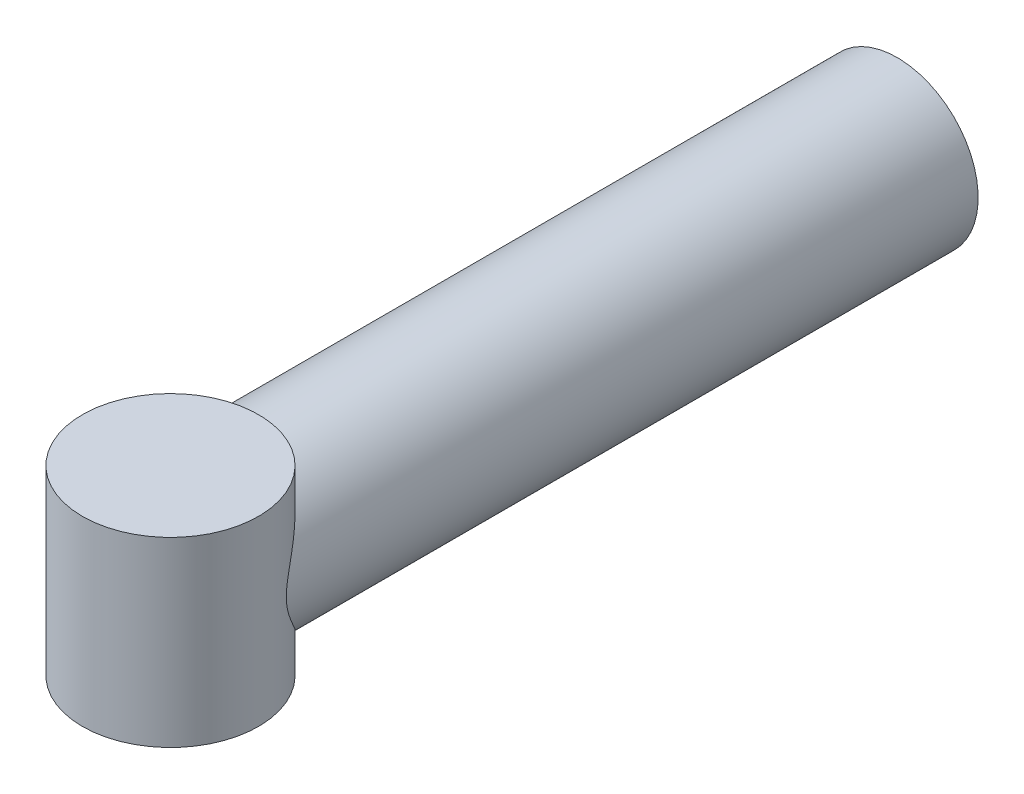
ISO-10303-21;
HEADER;
FILE_DESCRIPTION(('STEP AP214'),'2;1');
FILE_NAME('part.step','',(''),(''),'','','');
FILE_SCHEMA(('AUTOMOTIVE_DESIGN { 1 0 10303 214 1 1 1 1 }'));
ENDSEC;
DATA;
#1=APPLICATION_CONTEXT('core data for automotive mechanical design processes');
#2=APPLICATION_PROTOCOL_DEFINITION('international standard','automotive_design',2000,#1);
#3=PRODUCT_CONTEXT('',#1,'mechanical');
#4=PRODUCT('Part','Part','',(#3));
#5=PRODUCT_RELATED_PRODUCT_CATEGORY('part','',(#4));
#6=PRODUCT_DEFINITION_FORMATION('','',#4);
#7=PRODUCT_DEFINITION_CONTEXT('part definition',#1,'design');
#8=PRODUCT_DEFINITION('design','',#6,#7);
#9=PRODUCT_DEFINITION_SHAPE('','',#8);
#10=(LENGTH_UNIT() NAMED_UNIT(*) SI_UNIT(.MILLI.,.METRE.));
#11=(NAMED_UNIT(*) PLANE_ANGLE_UNIT() SI_UNIT($,.RADIAN.));
#12=(NAMED_UNIT(*) SI_UNIT($,.STERADIAN.) SOLID_ANGLE_UNIT());
#13=UNCERTAINTY_MEASURE_WITH_UNIT(LENGTH_MEASURE(1.E-05),#10,'distance_accuracy_value','');
#14=(GEOMETRIC_REPRESENTATION_CONTEXT(3) GLOBAL_UNCERTAINTY_ASSIGNED_CONTEXT((#13)) GLOBAL_UNIT_ASSIGNED_CONTEXT((#10,
#11,#12)) REPRESENTATION_CONTEXT('',''));
#15=CARTESIAN_POINT('',(0.,0.,0.));
#16=DIRECTION('',(0.,0.,1.));
#17=DIRECTION('',(1.,0.,0.));
#18=AXIS2_PLACEMENT_3D('',#15,#16,#17);
#19=CARTESIAN_POINT('',(0.,22.5,79.7384381673112));
#20=DIRECTION('',(0.,-1.,0.));
#21=DIRECTION('',(0.,0.,-1.));
#22=AXIS2_PLACEMENT_3D('',#19,#20,#21);
#23=CYLINDRICAL_SURFACE('',#22,21.7897785141328);
#24=CARTESIAN_POINT('',(0.,22.5,79.7384381673112));
#25=DIRECTION('',(0.,1.,0.));
#26=DIRECTION('',(0.,0.,1.));
#27=AXIS2_PLACEMENT_3D('',#24,#25,#26);
#28=CIRCLE('',#27,21.7897785141328);
#29=CARTESIAN_POINT('',(0.,22.5,101.528216681444));
#30=VERTEX_POINT('',#29);
#31=EDGE_CURVE('E94',#30,#30,#28,.T.);
#32=ORIENTED_EDGE('',*,*,#31,.F.);
#33=EDGE_LOOP('',(#32));
#34=FACE_BOUND('',#33,.T.);
#35=CARTESIAN_POINT('',(0.,-22.5,79.7384381673112));
#36=DIRECTION('',(0.,1.,0.));
#37=DIRECTION('',(0.,0.,1.));
#38=AXIS2_PLACEMENT_3D('',#35,#36,#37);
#39=CIRCLE('',#38,21.7897785141328);
#40=CARTESIAN_POINT('',(0.,-22.5,101.528216681444));
#41=VERTEX_POINT('',#40);
#42=EDGE_CURVE('E60',#41,#41,#39,.T.);
#43=ORIENTED_EDGE('',*,*,#42,.T.);
#44=EDGE_LOOP('',(#43));
#45=FACE_BOUND('',#44,.T.);
#46=CARTESIAN_POINT('',(-20.,0.,71.0900598398464));
#47=CARTESIAN_POINT('',(-20.0000003572792,-0.28248635995844,71.0900611760895));
#48=CARTESIAN_POINT('',(-19.9939947332945,-0.564967834462663,71.0761325087891));
#49=CARTESIAN_POINT('',(-19.9702133636225,-1.12679786874057,71.0214497676802));
#50=CARTESIAN_POINT('',(-19.9524362772046,-1.40614606795849,70.9806926382015));
#51=CARTESIAN_POINT('',(-19.9056454359633,-1.96035418023474,70.8748581883427));
#52=CARTESIAN_POINT('',(-19.8765852636115,-2.23519059963312,70.8096804431835));
#53=CARTESIAN_POINT('',(-19.8080374855605,-2.77786409045319,70.6586282622042));
#54=CARTESIAN_POINT('',(-19.7685440046747,-3.0456971244569,70.5727421675208));
#55=CARTESIAN_POINT('',(-19.6907617627878,-3.50925755055089,70.4070633814724));
#56=CARTESIAN_POINT('',(-19.6545254750975,-3.70664875964659,70.3308875822483));
#57=CARTESIAN_POINT('',(-19.5768885065106,-4.09695021890429,70.1703741962422));
#58=CARTESIAN_POINT('',(-19.5354895131355,-4.28986190894655,70.0860392784224));
#59=CARTESIAN_POINT('',(-19.4038760259827,-4.86242358702407,69.8226720285174));
#60=CARTESIAN_POINT('',(-19.3062837266498,-5.23567351611419,69.6333614371278));
#61=CARTESIAN_POINT('',(-19.0927621259315,-5.96759739242854,69.2354807974977));
#62=CARTESIAN_POINT('',(-18.9767787807289,-6.32622433661935,69.0268547654054));
#63=CARTESIAN_POINT('',(-18.7276432043651,-7.02954455884812,68.5970045337474));
#64=CARTESIAN_POINT('',(-18.594493853971,-7.37424016209786,68.3757824514976));
#65=CARTESIAN_POINT('',(-18.3241788616531,-8.02097612211901,67.9453182071517));
#66=CARTESIAN_POINT('',(-18.1884326031341,-8.32407754792096,67.7367693122606));
#67=CARTESIAN_POINT('',(-17.9033013564316,-8.92082720114438,67.3154364902626));
#68=CARTESIAN_POINT('',(-17.7539145700074,-9.21447417525667,67.102652007675));
#69=CARTESIAN_POINT('',(-17.4414881495564,-9.79298823916839,66.6747803988144));
#70=CARTESIAN_POINT('',(-17.2784409139607,-10.0778503182388,66.459692049358));
#71=CARTESIAN_POINT('',(-16.9387299103715,-10.6389356480963,66.0289829451423));
#72=CARTESIAN_POINT('',(-16.7620648522505,-10.9151580768854,65.8133621418169));
#73=CARTESIAN_POINT('',(-16.2119545434275,-11.730403788404,65.1684068786787));
#74=CARTESIAN_POINT('',(-15.8179607238608,-12.2568078143143,64.7403770732155));
#75=CARTESIAN_POINT('',(-14.9743114436707,-13.2742707988032,63.8979881856978));
#76=CARTESIAN_POINT('',(-14.5246860889363,-13.7653486491174,63.4836218618771));
#77=CARTESIAN_POINT('',(-13.6891202854943,-14.5897210158038,62.779043335664));
#78=CARTESIAN_POINT('',(-13.3157496671708,-14.9315554610108,62.4838922460962));
#79=CARTESIAN_POINT('',(-12.5367283975626,-15.5913765395692,61.9098375834796));
#80=CARTESIAN_POINT('',(-12.1310780668647,-15.9093634097024,61.6309338491174));
#81=CARTESIAN_POINT('',(-11.2879832649086,-16.5182107715538,61.0937267978679));
#82=CARTESIAN_POINT('',(-10.8505849964875,-16.8091093303085,60.8353946481816));
#83=CARTESIAN_POINT('',(-10.1709008734813,-17.2227501543266,60.4663414288393));
#84=CARTESIAN_POINT('',(-9.94042099926592,-17.3568395330614,60.3464036239859));
#85=CARTESIAN_POINT('',(-9.47162764837507,-17.6170416828864,60.1131668312528));
#86=CARTESIAN_POINT('',(-9.23331218491498,-17.7431524068401,59.9998695477199));
#87=CARTESIAN_POINT('',(-8.60475970769942,-18.0594905657577,59.7151402957496));
#88=CARTESIAN_POINT('',(-8.20861970868929,-18.2431423245337,59.5492985400035));
#89=CARTESIAN_POINT('',(-7.39828948240311,-18.5865248679967,59.2384861816186));
#90=CARTESIAN_POINT('',(-6.98410325143047,-18.7462609143627,59.0935109884143));
#91=CARTESIAN_POINT('',(-6.13942475905216,-19.0396228607865,58.8267677546328));
#92=CARTESIAN_POINT('',(-5.70893763283468,-19.1732569032616,58.7049924772261));
#93=CARTESIAN_POINT('',(-4.83387999030584,-19.4123491767946,58.4868180853634));
#94=CARTESIAN_POINT('',(-4.38930932145478,-19.5178071025585,58.3904192458666));
#95=CARTESIAN_POINT('',(-3.48603665147611,-19.6992674283498,58.2243908126248));
#96=CARTESIAN_POINT('',(-3.02725987452898,-19.7750675433687,58.1549450810515));
#97=CARTESIAN_POINT('',(-2.1020717635314,-19.8946936979974,58.0452891966034));
#98=CARTESIAN_POINT('',(-1.63566040870281,-19.9385196505719,58.0050791233094));
#99=CARTESIAN_POINT('',(-0.699442626089152,-19.9932633538939,57.9548455175677));
#100=CARTESIAN_POINT('',(-0.22963741167008,-20.0041923337382,57.9448116847228));
#101=CARTESIAN_POINT('',(0.709216063219477,-19.9929326169856,57.9551465038911));
#102=CARTESIAN_POINT('',(1.17826438185688,-19.9707465997382,57.9755126962244));
#103=CARTESIAN_POINT('',(2.0616027684016,-19.8978591879361,58.0423770654607));
#104=CARTESIAN_POINT('',(2.47640125457342,-19.8504487278428,58.0858589808239));
#105=CARTESIAN_POINT('',(3.29918613292553,-19.7303874221606,58.1958743269091));
#106=CARTESIAN_POINT('',(3.70717311084469,-19.6577387587078,58.2624057647306));
#107=CARTESIAN_POINT('',(4.51387812578193,-19.4883251122128,58.4173666096859));
#108=CARTESIAN_POINT('',(4.91259539190978,-19.3915581312242,58.5057978309803));
#109=CARTESIAN_POINT('',(5.69862480994007,-19.1752929955066,58.7031261447758));
#110=CARTESIAN_POINT('',(6.08593629004327,-19.0557935049159,58.8120244400071));
#111=CARTESIAN_POINT('',(6.86427751615628,-18.789844023563,59.0539150526225));
#112=CARTESIAN_POINT('',(7.25471359705718,-18.6424355580195,59.1877602148464));
#113=CARTESIAN_POINT('',(8.0197688429527,-18.3263375645778,59.4740701566773));
#114=CARTESIAN_POINT('',(8.39438800957018,-18.1576480388632,59.6265349343738));
#115=CARTESIAN_POINT('',(9.12684589740211,-17.8007496226652,59.9481590894689));
#116=CARTESIAN_POINT('',(9.48468144652722,-17.6125370637604,60.1173216041194));
#117=CARTESIAN_POINT('',(10.182866165579,-17.2183051734186,60.4704127788643));
#118=CARTESIAN_POINT('',(10.5232115852937,-17.0122820482529,60.6543445842856));
#119=CARTESIAN_POINT('',(11.3603997917174,-16.4713053061508,61.1353230142865));
#120=CARTESIAN_POINT('',(11.8453793759681,-16.1255426177975,61.4409723721199));
#121=CARTESIAN_POINT('',(12.773265036337,-15.4009914058984,62.0762023746111));
#122=CARTESIAN_POINT('',(13.2161519258357,-15.0221879712133,62.4057938128865));
#123=CARTESIAN_POINT('',(14.0612795385175,-14.2342939673675,63.0840331419917));
#124=CARTESIAN_POINT('',(14.4634009939412,-13.8251202682369,63.4327325984902));
#125=CARTESIAN_POINT('',(15.2262138066704,-12.9802294400468,64.1426615789099));
#126=CARTESIAN_POINT('',(15.5869129010945,-12.5445172913437,64.5038887463641));
#127=CARTESIAN_POINT('',(16.2762300953977,-11.6368870600109,65.2422280887121));
#128=CARTESIAN_POINT('',(16.6038326994043,-11.1643396230547,65.6195121216801));
#129=CARTESIAN_POINT('',(17.217367306302,-10.1927769991871,66.3745655799328));
#130=CARTESIAN_POINT('',(17.5032811361513,-9.69375039794832,66.7523351449128));
#131=CARTESIAN_POINT('',(17.9004857988479,-8.92498601079619,67.31187902848));
#132=CARTESIAN_POINT('',(18.0274779037477,-8.66567956837124,67.496993481501));
#133=CARTESIAN_POINT('',(18.2710064369723,-8.139677748946,67.8635434673288));
#134=CARTESIAN_POINT('',(18.3875440604192,-7.87298322110109,68.0449794188097));
#135=CARTESIAN_POINT('',(18.6099370782173,-7.33183145867082,68.402259919214));
#136=CARTESIAN_POINT('',(18.7158005929675,-7.05738033161961,68.5781086478247));
#137=CARTESIAN_POINT('',(18.9166591827064,-6.49983071063637,68.9220581501028));
#138=CARTESIAN_POINT('',(19.0116567029901,-6.2167341805159,69.0901606618822));
#139=CARTESIAN_POINT('',(19.1772978028237,-5.68308524466734,69.3919002304823));
#140=CARTESIAN_POINT('',(19.2494712615338,-5.43382809000155,69.5269824044619));
#141=CARTESIAN_POINT('',(19.3851943502404,-4.92776508253637,69.7870468129796));
#142=CARTESIAN_POINT('',(19.4487440979395,-4.67095933282386,69.9120291853577));
#143=CARTESIAN_POINT('',(19.5666038958633,-4.14962007147203,70.1488637407674));
#144=CARTESIAN_POINT('',(19.6209246713158,-3.88509595448173,70.2607311175386));
#145=CARTESIAN_POINT('',(19.7196999801292,-3.34783236365247,70.4679974996239));
#146=CARTESIAN_POINT('',(19.7641563150871,-3.07509440030461,70.5633995113901));
#147=CARTESIAN_POINT('',(19.835543689033,-2.56991465698943,70.7189224476781));
#148=CARTESIAN_POINT('',(19.8641782197508,-2.33872009183261,70.782293940923));
#149=CARTESIAN_POINT('',(19.91361222915,-1.8716702733388,70.8927516503787));
#150=CARTESIAN_POINT('',(19.9344141773357,-1.63581651370543,70.9398429991088));
#151=CARTESIAN_POINT('',(19.9676888311595,-1.1609987762512,71.0156188315472));
#152=CARTESIAN_POINT('',(19.9801769000767,-0.922041371792785,71.0443372628492));
#153=CARTESIAN_POINT('',(19.9965496539802,-0.442265787116113,71.0820599746344));
#154=CARTESIAN_POINT('',(20.0004346514609,-0.201447674804308,71.0910649711802));
#155=CARTESIAN_POINT('',(19.9994868890063,0.280675900510312,71.0888732663462));
#156=CARTESIAN_POINT('',(19.9946324871611,0.521981091178815,71.0776264140584));
#157=CARTESIAN_POINT('',(19.9763059050874,1.00251359399952,71.0354405772472));
#158=CARTESIAN_POINT('',(19.9628333922811,1.24174082560094,71.0045008327638));
#159=CARTESIAN_POINT('',(19.9275962101371,1.71691197309894,70.9244007797162));
#160=CARTESIAN_POINT('',(19.9058165438277,1.95284914619686,70.8752075223255));
#161=CARTESIAN_POINT('',(19.8544476126255,2.41995250095189,70.7607275529592));
#162=CARTESIAN_POINT('',(19.8248552400749,2.65111674454339,70.6954344376318));
#163=CARTESIAN_POINT('',(19.7389528416094,3.241529531484,70.5089218431146));
#164=CARTESIAN_POINT('',(19.6771344800041,3.59670107341507,70.3773154639281));
#165=CARTESIAN_POINT('',(19.5370469769259,4.29303738735554,70.0883598687633));
#166=CARTESIAN_POINT('',(19.4587659314387,4.63419180916719,69.9309920432674));
#167=CARTESIAN_POINT('',(19.2868375591216,5.30453102851535,69.5970497005369));
#168=CARTESIAN_POINT('',(19.1931332729075,5.63366571286817,69.4204048386497));
#169=CARTESIAN_POINT('',(18.9915317392251,6.27982906877321,69.0538728785239));
#170=CARTESIAN_POINT('',(18.8836366240762,6.59685954989148,68.8639877717798));
#171=CARTESIAN_POINT('',(18.6567744814889,7.21319436939717,68.4793089028174));
#172=CARTESIAN_POINT('',(18.5381058524331,7.51273585053304,68.2847172139081));
#173=CARTESIAN_POINT('',(18.2880490085117,8.1024592546616,67.8895389036377));
#174=CARTESIAN_POINT('',(18.1566586541723,8.39263959236797,67.6889512778459));
#175=CARTESIAN_POINT('',(17.8812449450892,8.96447722482946,67.2838989594852));
#176=CARTESIAN_POINT('',(17.7372135928139,9.24612897007442,67.079431877564));
#177=CARTESIAN_POINT('',(17.4366330883591,9.80119392963664,66.6685054884422));
#178=CARTESIAN_POINT('',(17.2800826489563,10.0746062927839,66.4620459783025));
#179=CARTESIAN_POINT('',(16.7917573383597,10.882707127326,65.8421178406379));
#180=CARTESIAN_POINT('',(16.4411515991456,11.4055843065955,65.4278652863788));
#181=CARTESIAN_POINT('',(15.6892206203267,12.4195952593169,64.6072554692453));
#182=CARTESIAN_POINT('',(15.2879199372172,12.910744228893,64.200894492935));
#183=CARTESIAN_POINT('',(14.5078388719998,13.7768037286288,63.4734518695891));
#184=CARTESIAN_POINT('',(14.13733066117,14.1570505792372,63.14985424267));
#185=CARTESIAN_POINT('',(13.3602314126824,14.892632379426,62.5178240715015));
#186=CARTESIAN_POINT('',(12.9536384316519,15.2479659854376,62.209392345415));
#187=CARTESIAN_POINT('',(12.1046768836881,15.930244914601,61.6127700580446));
#188=CARTESIAN_POINT('',(11.6623703386561,16.2572374916575,61.3245459635045));
#189=CARTESIAN_POINT('',(10.9720303193811,16.7239857301829,60.9107725089728));
#190=CARTESIAN_POINT('',(10.7374554735786,16.8756012652948,60.775951183973));
#191=CARTESIAN_POINT('',(10.2593245829736,17.1704737986945,60.5130603499061));
#192=CARTESIAN_POINT('',(10.0157663139267,17.3137287039564,60.3849925323003));
#193=CARTESIAN_POINT('',(9.38524365377179,17.6666167662132,60.0687978769084));
#194=CARTESIAN_POINT('',(8.99219360998417,17.8700761405912,59.8858007069753));
#195=CARTESIAN_POINT('',(8.186235509903,18.2533452503572,59.5401160415693));
#196=CARTESIAN_POINT('',(7.77333215133454,18.4331605432046,59.3774237739584));
#197=CARTESIAN_POINT('',(6.92913060676511,18.7668070500378,59.0748821213027));
#198=CARTESIAN_POINT('',(6.49783715271052,18.9206448983334,58.935026904267));
#199=CARTESIAN_POINT('',(5.61886605752035,19.2000253910914,58.6806108665613));
#200=CARTESIAN_POINT('',(5.17118820030012,19.325567662223,58.5660503796294));
#201=CARTESIAN_POINT('',(4.25868703321097,19.5470122082805,58.3637313842014));
#202=CARTESIAN_POINT('',(3.79375684931506,19.6426744812833,58.2761899613456));
#203=CARTESIAN_POINT('',(2.85367547428726,19.8011037797231,58.1310980970539));
#204=CARTESIAN_POINT('',(2.37852425422598,19.8638707120411,58.0735477405157));
#205=CARTESIAN_POINT('',(1.4224353310332,19.9551286011376,57.9898456990057));
#206=CARTESIAN_POINT('',(0.941500821485025,19.9836376699871,57.9636774223992));
#207=CARTESIAN_POINT('',(-0.0218212092103692,20.005788300199,57.9433471772745));
#208=CARTESIAN_POINT('',(-0.504208568186972,19.9994336187627,57.9491817598677));
#209=CARTESIAN_POINT('',(-1.40709908668984,19.9549193279786,57.9900314933659));
#210=CARTESIAN_POINT('',(-1.82797388316128,19.9207335357678,58.0214006603827));
#211=CARTESIAN_POINT('',(-2.66424332886874,19.8262158380741,58.1080677320468));
#212=CARTESIAN_POINT('',(-3.07963851330049,19.7658865058179,58.1633632816945));
#213=CARTESIAN_POINT('',(-3.90223646601112,19.620068120257,58.2968742652014));
#214=CARTESIAN_POINT('',(-4.30943885313428,19.5345778992638,58.3750907627953));
#215=CARTESIAN_POINT('',(-5.11326928763226,19.3397397320065,58.5531033116574));
#216=CARTESIAN_POINT('',(-5.5098967741772,19.2303905232165,58.6529005048905));
#217=CARTESIAN_POINT('',(-6.29852849405549,18.98689826423,58.8747332619868));
#218=CARTESIAN_POINT('',(-6.69027482841141,18.8522963712543,58.9971796660797));
#219=CARTESIAN_POINT('',(-7.45904300774888,18.5615620874849,59.2610771434985));
#220=CARTESIAN_POINT('',(-7.83606510566264,18.4054300667435,59.4025278901832));
#221=CARTESIAN_POINT('',(-8.57429760167227,18.0733308207,59.7026035402509));
#222=CARTESIAN_POINT('',(-8.93550394705475,17.8973585522466,59.8612328098002));
#223=CARTESIAN_POINT('',(-9.641232095497,17.5272780447933,60.1937883069976));
#224=CARTESIAN_POINT('',(-9.98575033965209,17.3331659629257,60.3677177754892));
#225=CARTESIAN_POINT('',(-10.8262977303207,16.8267141025745,60.819825061821));
#226=CARTESIAN_POINT('',(-11.3115366040743,16.503952388982,61.1064942120083));
#227=CARTESIAN_POINT('',(-12.2424452562332,15.8257543642277,61.7044888496532));
#228=CARTESIAN_POINT('',(-12.6880979931938,15.4703041137017,62.0158248478785));
#229=CARTESIAN_POINT('',(-13.5407693430654,14.729803830266,62.6584034521194));
#230=CARTESIAN_POINT('',(-13.9476997342337,14.3446896599089,62.9896888339062));
#231=CARTESIAN_POINT('',(-14.7222974190903,13.5485221167601,63.6663244098141));
#232=CARTESIAN_POINT('',(-15.0899704020456,13.1374725163599,64.0116725558814));
#233=CARTESIAN_POINT('',(-15.7951426190903,12.2812207042018,64.7196721216929));
#234=CARTESIAN_POINT('',(-16.1317210162458,11.8354402044192,65.0825396346472));
#235=CARTESIAN_POINT('',(-16.765420585543,10.9192972032391,65.811896894606));
#236=CARTESIAN_POINT('',(-17.0625315490443,10.448928385504,66.1783875525367));
#237=CARTESIAN_POINT('',(-17.6172638797565,9.48375304714811,66.9073997274666));
#238=CARTESIAN_POINT('',(-17.8749453566086,8.98898527631192,67.269926487795));
#239=CARTESIAN_POINT('',(-18.2319738499236,8.22640259138612,67.8038007391237));
#240=CARTESIAN_POINT('',(-18.3460519270311,7.96884578037025,67.9800789253475));
#241=CARTESIAN_POINT('',(-18.5642735484756,7.44633742606715,68.3277304426973));
#242=CARTESIAN_POINT('',(-18.6684183744524,7.18138684248035,68.4991044045892));
#243=CARTESIAN_POINT('',(-18.8689020499327,6.63706536769014,68.838951110321));
#244=CARTESIAN_POINT('',(-18.9649979819889,6.35750162080035,69.0072593390071));
#245=CARTESIAN_POINT('',(-19.1461392083139,5.78915314843404,69.3338886451562));
#246=CARTESIAN_POINT('',(-19.2311870838856,5.50037059658231,69.4922120510409));
#247=CARTESIAN_POINT('',(-19.3896570858591,4.91262107808144,69.7953555684276));
#248=CARTESIAN_POINT('',(-19.4630789026105,4.6136538404292,69.9401753202286));
#249=CARTESIAN_POINT('',(-19.5974170804695,4.0047946039629,70.2117056863148));
#250=CARTESIAN_POINT('',(-19.6583352928504,3.69490423039188,70.3384189805817));
#251=CARTESIAN_POINT('',(-19.7585521354798,3.1103293068833,70.5511737944867));
#252=CARTESIAN_POINT('',(-19.7997117336784,2.83715498387932,70.6404552430335));
#253=CARTESIAN_POINT('',(-19.8711863892135,2.28337645299683,70.7976397322475));
#254=CARTESIAN_POINT('',(-19.9015068985801,2.00277605691477,70.8655535187199));
#255=CARTESIAN_POINT('',(-19.9503360214293,1.43679047119892,70.9758923891488));
#256=CARTESIAN_POINT('',(-19.9688959543561,1.15143172568808,71.0184281665216));
#257=CARTESIAN_POINT('',(-19.9937267120661,0.577379900876563,71.0755088197463));
#258=CARTESIAN_POINT('',(-19.999999634878,0.288687399290344,71.0900584742706));
#259=CARTESIAN_POINT('',(-20.,0.,71.0900598398464));
#260=B_SPLINE_CURVE_WITH_KNOTS('',3,(#46,#47,#48,#49,#50,#51,#52,#53,#54,#55,#56,#57,#58,#59,
#60,#61,#62,#63,#64,#65,#66,#67,#68,#69,#70,#71,#72,#73,#74,#75,#76,#77,#78,#79,#80,#81,#82,#83,
#84,#85,#86,#87,#88,#89,#90,#91,#92,#93,#94,#95,#96,#97,#98,#99,#100,#101,#102,#103,#104,#105,
#106,#107,#108,#109,#110,#111,#112,#113,#114,#115,#116,#117,#118,#119,#120,#121,#122,#123,#124,
#125,#126,#127,#128,#129,#130,#131,#132,#133,#134,#135,#136,#137,#138,#139,#140,#141,#142,#143,
#144,#145,#146,#147,#148,#149,#150,#151,#152,#153,#154,#155,#156,#157,#158,#159,#160,#161,#162,
#163,#164,#165,#166,#167,#168,#169,#170,#171,#172,#173,#174,#175,#176,#177,#178,#179,#180,#181,
#182,#183,#184,#185,#186,#187,#188,#189,#190,#191,#192,#193,#194,#195,#196,#197,#198,#199,#200,
#201,#202,#203,#204,#205,#206,#207,#208,#209,#210,#211,#212,#213,#214,#215,#216,#217,#218,#219,
#220,#221,#222,#223,#224,#225,#226,#227,#228,#229,#230,#231,#232,#233,#234,#235,#236,#237,#238,
#239,#240,#241,#242,#243,#244,#245,#246,#247,#248,#249,#250,#251,#252,#253,#254,#255,#256,#257,
#258,#259),.UNSPECIFIED.,.T.,.F.,(4,2,2,2,2,2,2,2,2,2,2,2,2,2,2,2,2,2,2,2,2,2,2,2,2,2,2,2,2,2,2,
2,2,2,2,2,2,2,2,2,2,2,2,2,2,2,2,2,2,2,2,2,2,2,2,2,2,2,2,2,2,2,2,2,2,2,2,2,2,2,2,2,2,2,2,2,2,2,2,
2,2,2,2,2,2,2,2,2,2,2,2,2,2,2,2,2,2,2,2,2,2,2,2,2,2,2,4),(0.,0.847061951426545,1.69422039700871,
2.54490154196973,3.39606274591446,4.03976964706402,4.68326669006242,5.97099261850597,
7.26257527894536,8.55394146984323,9.73003835955019,10.9062905194306,12.0832016266586,
13.2602243696371,15.611000827189,17.9605106437044,19.7170016540209,21.4734752218796,
23.2274419522324,24.1043339654017,24.9814500636822,26.3812529618232,27.7807474363319,
29.1798046443653,30.5788770108573,31.9873321804388,33.395791183888,34.8037693675039,
36.2116336371393,37.4694584047576,38.7271744458596,39.9849947100211,41.2428889120458,
42.5564374522148,43.8699858576101,45.1837815303204,46.4978577400449,48.5032384839807,
50.5095289766565,52.5215294423595,54.5331534811019,56.5945869875509,58.6569164481209,
59.6856467510954,60.7142593027346,61.7420833309049,62.7696755994726,63.6469894527702,
64.5242913306506,65.4005665940428,66.2766816864855,67.0003313221939,67.7237526098081,
68.445833343568,69.1678878483334,69.891732881106,70.6156058491646,71.3407918641609,
72.0662667719239,73.2156146290938,74.3657964443101,75.520325429202,76.6746811318953,
77.8034518542551,78.9324127382224,80.06209309852,81.1918897632304,83.4501959465387,
85.7074123771041,87.5710854550738,89.4348589635513,91.2954626350188,92.2256255060946,
93.1560202469021,94.5913961068917,96.0264339813782,97.4611048092916,98.8957945650927,
100.341728104621,101.787665737227,103.232838568379,104.677855659011,105.94662256329,
107.215264615173,108.483965552592,109.75273364107,111.047294474389,112.341833060014,
113.636701446737,114.931844772185,116.877341685308,118.823672097468,120.774335709062,
122.724716241543,124.721288044638,126.718375279247,128.712386984433,129.709075836354,
130.705635915846,131.725768989794,132.745663286277,133.765584742237,134.785355080368,
135.655418929428,136.525044521076,137.390848723369,138.25650507517),.UNSPECIFIED.);
#261=CARTESIAN_POINT('',(-20.,0.,71.0900598398464));
#262=VERTEX_POINT('',#261);
#263=EDGE_CURVE('E10',#262,#262,#260,.T.);
#264=ORIENTED_EDGE('',*,*,#263,.T.);
#265=EDGE_LOOP('',(#264));
#266=FACE_BOUND('',#265,.T.);
#267=ADVANCED_FACE('F36',(#34,#45,#266),#23,.T.);
#268=CARTESIAN_POINT('',(0.,22.5,79.7384381673112));
#269=DIRECTION('',(0.,1.,0.));
#270=DIRECTION('',(0.,0.,1.));
#271=AXIS2_PLACEMENT_3D('',#268,#269,#270);
#272=PLANE('',#271);
#273=ORIENTED_EDGE('',*,*,#31,.T.);
#274=EDGE_LOOP('',(#273));
#275=FACE_BOUND('',#274,.T.);
#276=ADVANCED_FACE('F85',(#275),#272,.T.);
#277=CARTESIAN_POINT('',(0.,-22.5,79.7384381673112));
#278=DIRECTION('',(0.,1.,0.));
#279=DIRECTION('',(0.,0.,1.));
#280=AXIS2_PLACEMENT_3D('',#277,#278,#279);
#281=PLANE('',#280);
#282=ORIENTED_EDGE('',*,*,#42,.F.);
#283=EDGE_LOOP('',(#282));
#284=FACE_BOUND('',#283,.T.);
#285=ADVANCED_FACE('F69',(#284),#281,.F.);
#286=CARTESIAN_POINT('',(0.,0.,80.));
#287=DIRECTION('',(0.,0.,-1.));
#288=DIRECTION('',(-1.,0.,0.));
#289=AXIS2_PLACEMENT_3D('',#286,#287,#288);
#290=CYLINDRICAL_SURFACE('',#289,20.);
#291=CARTESIAN_POINT('',(0.,0.,-100.));
#292=DIRECTION('',(0.,0.,-1.));
#293=DIRECTION('',(-1.,0.,0.));
#294=AXIS2_PLACEMENT_3D('',#291,#292,#293);
#295=CIRCLE('',#294,20.);
#296=CARTESIAN_POINT('',(-20.,0.,-100.));
#297=VERTEX_POINT('',#296);
#298=EDGE_CURVE('E49',#297,#297,#295,.T.);
#299=ORIENTED_EDGE('',*,*,#298,.F.);
#300=EDGE_LOOP('',(#299));
#301=FACE_BOUND('',#300,.T.);
#302=ORIENTED_EDGE('',*,*,#263,.F.);
#303=EDGE_LOOP('',(#302));
#304=FACE_BOUND('',#303,.T.);
#305=ADVANCED_FACE('F38',(#301,#304),#290,.T.);
#306=CARTESIAN_POINT('',(0.,0.,80.));
#307=DIRECTION('',(0.,0.,-1.));
#308=DIRECTION('',(-1.,0.,0.));
#309=AXIS2_PLACEMENT_3D('',#306,#307,#308);
#310=CYLINDRICAL_SURFACE('',#309,15.);
#311=CARTESIAN_POINT('',(0.,0.,-100.));
#312=DIRECTION('',(0.,0.,-1.));
#313=DIRECTION('',(-1.,0.,0.));
#314=AXIS2_PLACEMENT_3D('',#311,#312,#313);
#315=CIRCLE('',#314,15.);
#316=CARTESIAN_POINT('',(-15.,0.,-100.));
#317=VERTEX_POINT('',#316);
#318=EDGE_CURVE('E54',#317,#317,#315,.T.);
#319=ORIENTED_EDGE('',*,*,#318,.T.);
#320=EDGE_LOOP('',(#319));
#321=FACE_BOUND('',#320,.T.);
#322=CARTESIAN_POINT('',(-15.,0.,63.9335513377587));
#323=CARTESIAN_POINT('',(-14.9999965125222,-0.362177097061445,63.933545087432));
#324=CARTESIAN_POINT('',(-14.9868527580879,-0.724405802017627,63.9210416143776));
#325=CARTESIAN_POINT('',(-14.9345819629865,-1.44532788372272,63.8716819780383));
#326=CARTESIAN_POINT('',(-14.8954494567292,-1.80402050070439,63.8348206921677));
#327=CARTESIAN_POINT('',(-14.7919937530774,-2.51520582213886,63.7385526002777));
#328=CARTESIAN_POINT('',(-14.7276320143901,-2.86768817452836,63.6791113043512));
#329=CARTESIAN_POINT('',(-14.5749070844514,-3.5635793877466,63.5403783848185));
#330=CARTESIAN_POINT('',(-14.4865298835007,-3.90698282357194,63.4610751766565));
#331=CARTESIAN_POINT('',(-14.2882408596077,-4.57903996400495,63.2867565313099));
#332=CARTESIAN_POINT('',(-14.1785741778342,-4.90781361419552,63.1919217152761));
#333=CARTESIAN_POINT('',(-13.9384178413728,-5.55329339187417,62.9891207869689));
#334=CARTESIAN_POINT('',(-13.8079353929933,-5.87000364881113,62.8811592221718));
#335=CARTESIAN_POINT('',(-13.527220521727,-6.49079127389133,62.6550771376933));
#336=CARTESIAN_POINT('',(-13.3769861643358,-6.79486740080248,62.5369556233377));
#337=CARTESIAN_POINT('',(-13.057699526354,-7.38989175952804,62.2933453651144));
#338=CARTESIAN_POINT('',(-12.8886459323197,-7.68083907305426,62.1678561073219));
#339=CARTESIAN_POINT('',(-12.5025144043006,-8.29702556405656,61.8905487958121));
#340=CARTESIAN_POINT('',(-12.282140697781,-8.61980723449827,61.737851021262));
#341=CARTESIAN_POINT('',(-11.8176593423237,-9.24635178276289,61.4295578315096));
#342=CARTESIAN_POINT('',(-11.5735499608615,-9.55011326959202,61.2739622054573));
#343=CARTESIAN_POINT('',(-11.0620433186142,-10.1382060348609,60.9630469467649));
#344=CARTESIAN_POINT('',(-10.7946205147857,-10.4225153765743,60.8077278120303));
#345=CARTESIAN_POINT('',(-10.2373603312507,-10.9703755382432,60.5006592614612));
#346=CARTESIAN_POINT('',(-9.94752147790624,-11.2339249911344,60.3489100811734));
#347=CARTESIAN_POINT('',(-9.29824453243025,-11.7792099775317,60.028335698618));
#348=CARTESIAN_POINT('',(-8.93506692874337,-12.0571761905864,59.8606308835689));
#349=CARTESIAN_POINT('',(-8.18071236508024,-12.5812105089892,59.538472434733));
#350=CARTESIAN_POINT('',(-7.78953049977268,-12.8272730046385,59.3840211329498));
#351=CARTESIAN_POINT('',(-6.98167482357663,-13.2842473240543,59.092985878046));
#352=CARTESIAN_POINT('',(-6.56504182944589,-13.4952135093358,58.9563743643855));
#353=CARTESIAN_POINT('',(-5.70844261967422,-13.8792559768513,58.7049621501485));
#354=CARTESIAN_POINT('',(-5.26848620570321,-14.0523480213254,58.5901523788883));
#355=CARTESIAN_POINT('',(-4.48678312574707,-14.3175326535649,58.4128849100989));
#356=CARTESIAN_POINT('',(-4.149495437688,-14.4189661328754,58.3445913559355));
#357=CARTESIAN_POINT('',(-3.46605943890999,-14.598327399621,58.2232985686367));
#358=CARTESIAN_POINT('',(-3.11991296187235,-14.6762600094887,58.170296197812));
#359=CARTESIAN_POINT('',(-2.42111432717048,-14.8075833058341,58.0807220487224));
#360=CARTESIAN_POINT('',(-2.06846630542592,-14.8609890702425,58.0441401762347));
#361=CARTESIAN_POINT('',(-1.35888749740999,-14.9425886664913,57.9881618517001));
#362=CARTESIAN_POINT('',(-1.00195656811692,-14.9707816539985,57.9687659751835));
#363=CARTESIAN_POINT('',(-0.285818342096618,-15.0015662052067,57.947584341385));
#364=CARTESIAN_POINT('',(0.0733919057876555,-15.0041113308271,57.9458305268735));
#365=CARTESIAN_POINT('',(0.790713463877849,-14.9834414521212,57.9600564605931));
#366=CARTESIAN_POINT('',(1.14882477817339,-14.9602265437764,57.9760361427495));
#367=CARTESIAN_POINT('',(1.86135426432248,-14.8883717846132,58.0253687972915));
#368=CARTESIAN_POINT('',(2.21577153291349,-14.8397258576007,58.0587259216359));
#369=CARTESIAN_POINT('',(2.91831835045712,-14.7176948869371,58.1420725887474));
#370=CARTESIAN_POINT('',(3.26644788518655,-14.644309787332,58.1920621691331));
#371=CARTESIAN_POINT('',(3.94713601046372,-14.4755160890388,58.3064236883939));
#372=CARTESIAN_POINT('',(4.27986743047115,-14.3805884162112,58.3704806971417));
#373=CARTESIAN_POINT('',(4.93532625657492,-14.1690211312056,58.5122881096808));
#374=CARTESIAN_POINT('',(5.2580538672184,-14.0523819633028,58.5900382332726));
#375=CARTESIAN_POINT('',(5.89202157794062,-13.7985752478774,58.7578266204953));
#376=CARTESIAN_POINT('',(6.20326136212052,-13.6614071363616,58.8478652217224));
#377=CARTESIAN_POINT('',(6.81307835821208,-13.3677419492456,59.0387154771064));
#378=CARTESIAN_POINT('',(7.11165388861024,-13.2112423176021,59.1395285556433));
#379=CARTESIAN_POINT('',(7.72801561554848,-12.8614566912527,59.3621941462313));
#380=CARTESIAN_POINT('',(8.04418341865345,-12.6660129047011,59.485137653418));
#381=CARTESIAN_POINT('',(8.65866766411191,-12.254154946079,59.7401231050521));
#382=CARTESIAN_POINT('',(8.95698296974874,-12.0377394409756,59.8721656277091));
#383=CARTESIAN_POINT('',(9.5353023705513,-11.5850331106768,60.1431702682722));
#384=CARTESIAN_POINT('',(9.81528843109959,-11.3487232182256,60.2821389711453));
#385=CARTESIAN_POINT('',(10.3560589863252,-10.8575088657946,60.5645091199271));
#386=CARTESIAN_POINT('',(10.6168419548133,-10.6026029310696,60.7079109168782));
#387=CARTESIAN_POINT('',(11.1622437656266,-10.0293000766598,61.0217572188455));
#388=CARTESIAN_POINT('',(11.4431454683559,-9.70756165327734,61.192576061569));
#389=CARTESIAN_POINT('',(11.976927266968,-9.04077675541374,61.5327290975183));
#390=CARTESIAN_POINT('',(12.2298017307971,-8.69572561860109,61.7020629860708));
#391=CARTESIAN_POINT('',(12.7063243855136,-7.98329156820444,62.0345362777091));
#392=CARTESIAN_POINT('',(12.9299797320171,-7.61591415462598,62.1976771904548));
#393=CARTESIAN_POINT('',(13.3466314357605,-6.85957221339418,62.5125844636304));
#394=CARTESIAN_POINT('',(13.539637182061,-6.47061434605915,62.6643542998706));
#395=CARTESIAN_POINT('',(13.8515304768053,-5.76598936380867,62.9170274038461));
#396=CARTESIAN_POINT('',(13.9771763418471,-5.45458385434984,63.0215019412016));
#397=CARTESIAN_POINT('',(14.2083396413119,-4.82046791125307,63.2175272978719));
#398=CARTESIAN_POINT('',(14.3138622275757,-4.49776039619624,63.3090814234282));
#399=CARTESIAN_POINT('',(14.5034713726243,-3.84258039451478,63.47621992765));
#400=CARTESIAN_POINT('',(14.587589984697,-3.51012335091336,63.5518281565078));
#401=CARTESIAN_POINT('',(14.7333718641886,-2.83662355260294,63.6844063258352));
#402=CARTESIAN_POINT('',(14.79503537495,-2.49558089097779,63.7413764682823));
#403=CARTESIAN_POINT('',(14.8952612527898,-1.80398838207816,63.834652259931));
#404=CARTESIAN_POINT('',(14.9336040262129,-1.45337969066661,63.8707613218566));
#405=CARTESIAN_POINT('',(14.9854676828041,-0.748698435212735,63.9197308869884));
#406=CARTESIAN_POINT('',(14.9989892240886,-0.394625963260215,63.9325920065961));
#407=CARTESIAN_POINT('',(15.0009013775918,0.313608141820198,63.9344068422259));
#408=CARTESIAN_POINT('',(14.9892946863811,0.667769761303391,63.9233631235333));
#409=CARTESIAN_POINT('',(14.9412214676107,1.37286806944612,63.8779391248485));
#410=CARTESIAN_POINT('',(14.9047556792789,1.7238048536872,63.8435595387887));
#411=CARTESIAN_POINT('',(14.8138157918995,2.37600151972481,63.7588068316491));
#412=CARTESIAN_POINT('',(14.7621574128258,2.6779947675419,63.7109654632995));
#413=CARTESIAN_POINT('',(14.6411295390271,3.27571974020924,63.600331329892));
#414=CARTESIAN_POINT('',(14.5717536365582,3.57144915768097,63.5375331560903));
#415=CARTESIAN_POINT('',(14.4160932776062,4.15543451706225,63.3988680430605));
#416=CARTESIAN_POINT('',(14.3298000291336,4.44368648434115,63.3229943109208));
#417=CARTESIAN_POINT('',(14.1411558970226,5.01171771992063,63.1602090024189));
#418=CARTESIAN_POINT('',(14.0388013729254,5.29149505016069,63.0732949244979));
#419=CARTESIAN_POINT('',(13.7680064317016,5.96906287929053,62.8482009034064));
#420=CARTESIAN_POINT('',(13.5908732168564,6.36169850673823,62.7048791866156));
#421=CARTESIAN_POINT('',(13.2060093770567,7.12633631462007,62.4047907726763));
#422=CARTESIAN_POINT('',(12.9982669422316,7.49833045440359,62.2480188958859));
#423=CARTESIAN_POINT('',(12.5534443496832,8.2214039729057,61.9260552691484));
#424=CARTESIAN_POINT('',(12.316317242895,8.5724485187968,61.7608502995055));
#425=CARTESIAN_POINT('',(11.8142222283828,9.25217110766371,61.4269800898103));
#426=CARTESIAN_POINT('',(11.5492574463352,9.58085165490559,61.2583152399489));
#427=CARTESIAN_POINT('',(10.9878898554861,10.220083611898,60.9190328142018));
#428=CARTESIAN_POINT('',(10.6910488681638,10.5302570573842,60.7484276267231));
#429=CARTESIAN_POINT('',(10.0703708037446,11.12530696679,60.4121174118163));
#430=CARTESIAN_POINT('',(9.74653173358854,11.4101815598796,60.2464127473814));
#431=CARTESIAN_POINT('',(9.07324515113072,11.9525237281391,59.9240545802716));
#432=CARTESIAN_POINT('',(8.72383265826235,12.2100276405891,59.7673892067181));
#433=CARTESIAN_POINT('',(8.00022113758255,12.6959159205349,59.4666763979639));
#434=CARTESIAN_POINT('',(7.6260271836045,12.924306221006,59.3226263937938));
#435=CARTESIAN_POINT('',(6.92010734673068,13.3133684120658,59.073931348073));
#436=CARTESIAN_POINT('',(6.59197519522505,13.4789520583277,58.9667504061657));
#437=CARTESIAN_POINT('',(5.92107514087102,13.7868428375602,58.7656489034918));
#438=CARTESIAN_POINT('',(5.57830991818568,13.9291542101626,58.6717259278796));
#439=CARTESIAN_POINT('',(4.87990818715323,14.1889124749518,58.4990815168762));
#440=CARTESIAN_POINT('',(4.52427695725066,14.3063694315123,58.4203539295096));
#441=CARTESIAN_POINT('',(3.80209456792883,14.5150034924922,58.2797842404921));
#442=CARTESIAN_POINT('',(3.4355432907461,14.6061803133893,58.2179423210121));
#443=CARTESIAN_POINT('',(2.6920746000054,14.7613579362769,58.1123224028787));
#444=CARTESIAN_POINT('',(2.31511244770029,14.8252117328333,58.0686421537798));
#445=CARTESIAN_POINT('',(1.5556556932391,14.924026139743,58.000919765193));
#446=CARTESIAN_POINT('',(1.17316107559548,14.9589866691969,57.9768776806908));
#447=CARTESIAN_POINT('',(0.405964250491747,14.999423889912,57.9490611895205));
#448=CARTESIAN_POINT('',(0.0212625630932589,15.0049072626633,57.9452821898861));
#449=CARTESIAN_POINT('',(-0.747068269622803,14.9863115534984,57.9580815842463));
#450=CARTESIAN_POINT('',(-1.13069748140948,14.9622343462896,57.9746586872738));
#451=CARTESIAN_POINT('',(-1.85999054767516,14.8883421104054,58.0253882276845));
#452=CARTESIAN_POINT('',(-2.20602412106725,14.8409788775813,58.0578653797504));
#453=CARTESIAN_POINT('',(-2.89212091557999,14.7226629343946,58.1386839232183));
#454=CARTESIAN_POINT('',(-3.23218455166133,14.6517118704737,58.1870242073633));
#455=CARTESIAN_POINT('',(-3.9042982133844,14.4871044020517,58.2985924976303));
#456=CARTESIAN_POINT('',(-4.2363472827052,14.3934453025463,58.3618222708208));
#457=CARTESIAN_POINT('',(-4.89060001875089,14.1844978172506,58.5019501667779));
#458=CARTESIAN_POINT('',(-5.21280318252383,14.06920832867,58.5788489864281));
#459=CARTESIAN_POINT('',(-5.85973468225725,13.812669808477,58.7485682536711));
#460=CARTESIAN_POINT('',(-6.18395456655916,13.6705043533194,58.841938873778));
#461=CARTESIAN_POINT('',(-6.81865370479577,13.3652530457725,59.0403468399189));
#462=CARTESIAN_POINT('',(-7.12913272510645,13.2021668378693,59.1453843842091));
#463=CARTESIAN_POINT('',(-7.73531379915245,12.8563870271688,59.3653349371132));
#464=CARTESIAN_POINT('',(-8.03101521246296,12.6736925756769,59.4802483731379));
#465=CARTESIAN_POINT('',(-8.60685316251048,12.2899076443082,59.7181085407925));
#466=CARTESIAN_POINT('',(-8.88698783894372,12.0888149733179,59.8410562287522));
#467=CARTESIAN_POINT('',(-9.47388849447768,11.6363013370332,60.1129377458304));
#468=CARTESIAN_POINT('',(-9.77790745064882,11.3819404091031,60.2629160997257));
#469=CARTESIAN_POINT('',(-10.3634983745702,10.8514527505307,60.5681123056644));
#470=CARTESIAN_POINT('',(-10.6450682781031,10.5753240229451,60.7233306376666));
#471=CARTESIAN_POINT('',(-11.1856636505549,10.0018269984095,61.0362163295919));
#472=CARTESIAN_POINT('',(-11.4446401027022,9.70441495089044,61.1938881806025));
#473=CARTESIAN_POINT('',(-11.938681995137,9.08973966351759,61.5080233212556));
#474=CARTESIAN_POINT('',(-12.1737462712196,8.77247545834132,61.6644865517119));
#475=CARTESIAN_POINT('',(-12.6510931768931,8.07182837581895,61.9947037559379));
#476=CARTESIAN_POINT('',(-12.8895723832791,7.68549013745132,62.1677175922445));
#477=CARTESIAN_POINT('',(-13.3325368315754,6.88849313179706,62.5014185221139));
#478=CARTESIAN_POINT('',(-13.537012175264,6.47782732998818,62.6621020191197));
#479=CARTESIAN_POINT('',(-13.9090114154824,5.63480207944298,62.9637244009461));
#480=CARTESIAN_POINT('',(-14.0766524104201,5.20251690260923,63.1047253206815));
#481=CARTESIAN_POINT('',(-14.3728440120265,4.31726008775133,63.3599722920262));
#482=CARTESIAN_POINT('',(-14.501426740808,3.86430580291769,63.474240311306));
#483=CARTESIAN_POINT('',(-14.6729835435301,3.12784883984571,63.6292664200639));
#484=CARTESIAN_POINT('',(-14.7295616423144,2.84976450877506,63.6810771826841));
#485=CARTESIAN_POINT('',(-14.8270949323251,2.28872283314869,63.7710923940985));
#486=CARTESIAN_POINT('',(-14.8680542983098,2.00576681191934,63.8093004785947));
#487=CARTESIAN_POINT('',(-14.9337999689112,1.43654088356793,63.8709207960856));
#488=CARTESIAN_POINT('',(-14.958595802598,1.15027303041194,63.89434174645));
#489=CARTESIAN_POINT('',(-14.9916952298615,0.576014044775555,63.9256576433033));
#490=CARTESIAN_POINT('',(-15.000002773436,0.288023341613518,63.9335563083655));
#491=CARTESIAN_POINT('',(-15.,0.,63.9335513377587));
#492=B_SPLINE_CURVE_WITH_KNOTS('',3,(#322,#323,#324,#325,#326,#327,#328,#329,#330,#331,#332,
#333,#334,#335,#336,#337,#338,#339,#340,#341,#342,#343,#344,#345,#346,#347,#348,#349,#350,#351,
#352,#353,#354,#355,#356,#357,#358,#359,#360,#361,#362,#363,#364,#365,#366,#367,#368,#369,#370,
#371,#372,#373,#374,#375,#376,#377,#378,#379,#380,#381,#382,#383,#384,#385,#386,#387,#388,#389,
#390,#391,#392,#393,#394,#395,#396,#397,#398,#399,#400,#401,#402,#403,#404,#405,#406,#407,#408,
#409,#410,#411,#412,#413,#414,#415,#416,#417,#418,#419,#420,#421,#422,#423,#424,#425,#426,#427,
#428,#429,#430,#431,#432,#433,#434,#435,#436,#437,#438,#439,#440,#441,#442,#443,#444,#445,#446,
#447,#448,#449,#450,#451,#452,#453,#454,#455,#456,#457,#458,#459,#460,#461,#462,#463,#464,#465,
#466,#467,#468,#469,#470,#471,#472,#473,#474,#475,#476,#477,#478,#479,#480,#481,#482,#483,#484,
#485,#486,#487,#488,#489,#490,#491),.UNSPECIFIED.,.T.,.F.,(4,2,2,2,2,2,2,2,2,2,2,2,2,2,2,2,2,2,
2,2,2,2,2,2,2,2,2,2,2,2,2,2,2,2,2,2,2,2,2,2,2,2,2,2,2,2,2,2,2,2,2,2,2,2,2,2,2,2,2,2,2,2,2,2,2,2,
2,2,2,2,2,2,2,2,2,2,2,2,2,2,2,2,2,2,4),(0.,1.08617659196025,2.1725816857247,3.26065292872168,
4.34936027845392,5.42620472312458,6.50267717573807,7.57925513683815,8.65590828228613,
9.9135551878293,11.1712939610831,12.4304285072297,13.6896458997407,15.1490426548491,
16.6086956718093,18.0660663112423,19.5228292721275,20.5980352570037,21.6730204567577,
22.7473439195293,23.8217033582288,24.8980076859768,25.9743080034515,27.050865597314,
28.1274256261014,29.181976219913,30.236505237166,31.2910632308907,32.3457608094509,
33.5191282844367,34.6925703915775,35.867150244228,37.0418233475256,38.4203464542103,
39.7991460737966,41.1776073967346,42.5556456300411,43.609785321033,44.6636547741494,
45.7159366028522,46.7682070278015,47.8302383852833,48.8922415833928,49.9541308210553,
51.0159884829913,51.9453135132581,52.8749751216392,53.8051211645734,54.7354783403359,
56.095396592431,57.4558409186776,58.8184876058003,60.1809814550959,61.5654535721344,
62.9500279846709,64.3327406546592,65.7151710937899,66.8626030675634,68.0098257742276,
69.1565830397822,70.3033526766246,71.4562169548303,72.6090844609804,73.7616906394249,
74.9142237243208,75.9653179926273,77.0163389094638,78.0674846232509,79.1186839425697,
80.2159636823117,81.3132620709904,82.4106079726926,83.5080847319954,84.7782779537175,
86.0485878368536,87.3215884802385,88.594651072184,90.0503718267914,91.5065155898158,
92.9579609736555,94.4082094145292,95.2729457924522,96.1374508712004,97.0014458264471,
97.865233774766),.UNSPECIFIED.);
#493=CARTESIAN_POINT('',(-15.,0.,63.9335513377587));
#494=VERTEX_POINT('',#493);
#495=EDGE_CURVE('E41',#494,#494,#492,.T.);
#496=ORIENTED_EDGE('',*,*,#495,.T.);
#497=EDGE_LOOP('',(#496));
#498=FACE_BOUND('',#497,.T.);
#499=ADVANCED_FACE('F73',(#321,#498),#310,.F.);
#500=CARTESIAN_POINT('',(0.,0.,-100.));
#501=DIRECTION('',(0.,0.,-1.));
#502=DIRECTION('',(-1.,0.,0.));
#503=AXIS2_PLACEMENT_3D('',#500,#501,#502);
#504=PLANE('',#503);
#505=ORIENTED_EDGE('',*,*,#298,.T.);
#506=EDGE_LOOP('',(#505));
#507=FACE_BOUND('',#506,.T.);
#508=ORIENTED_EDGE('',*,*,#318,.F.);
#509=EDGE_LOOP('',(#508));
#510=FACE_BOUND('',#509,.T.);
#511=ADVANCED_FACE('F67',(#507,#510),#504,.T.);
#512=ORIENTED_EDGE('',*,*,#495,.F.);
#513=EDGE_LOOP('',(#512));
#514=FACE_BOUND('',#513,.T.);
#515=ADVANCED_FACE('F62',(#514),#23,.T.);
#516=CLOSED_SHELL('',(#267,#276,#285,#305,#499,#511,#515));
#517=MANIFOLD_SOLID_BREP('B2',#516);
#518=ADVANCED_BREP_SHAPE_REPRESENTATION('',(#18,#517),#14);
#519=SHAPE_DEFINITION_REPRESENTATION(#9,#518);
ENDSEC;
END-ISO-10303-21;
